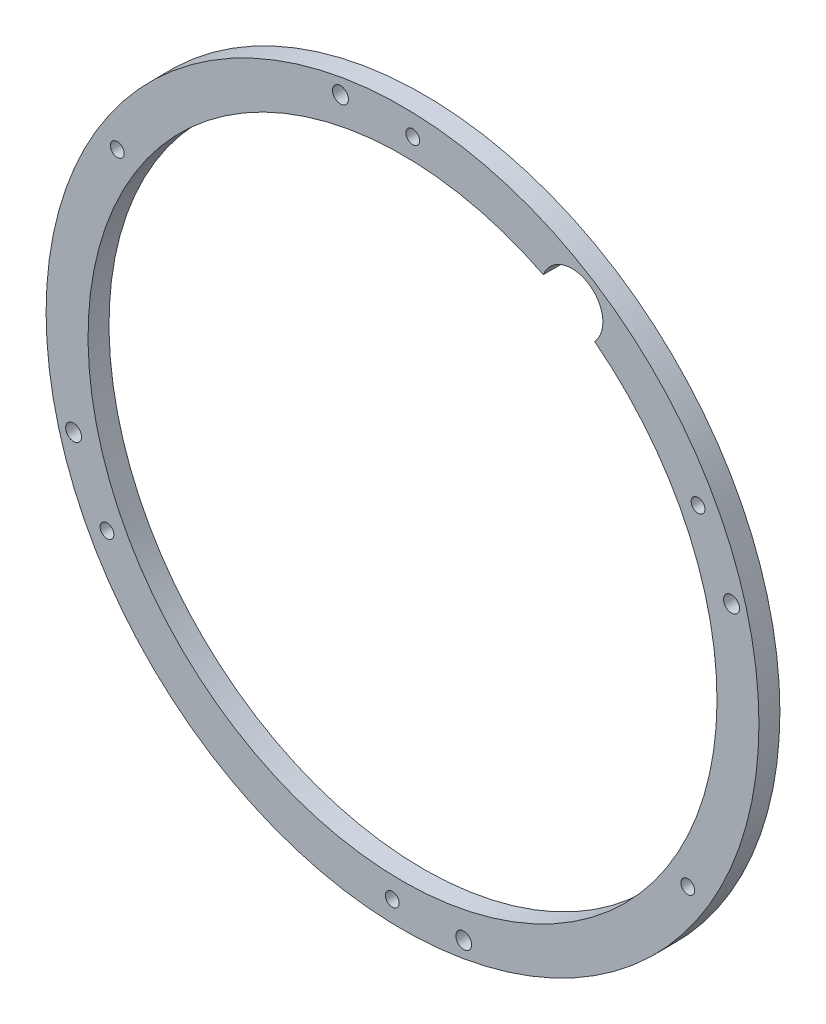
ISO-10303-21;
HEADER;
FILE_DESCRIPTION(('STEP AP214'),'2;1');
FILE_NAME('part.step','',(''),(''),'','','');
FILE_SCHEMA(('AUTOMOTIVE_DESIGN { 1 0 10303 214 1 1 1 1 }'));
ENDSEC;
DATA;
#1=APPLICATION_CONTEXT('core data for automotive mechanical design processes');
#2=APPLICATION_PROTOCOL_DEFINITION('international standard','automotive_design',2000,#1);
#3=PRODUCT_CONTEXT('',#1,'mechanical');
#4=PRODUCT('Part','Part','',(#3));
#5=PRODUCT_RELATED_PRODUCT_CATEGORY('part','',(#4));
#6=PRODUCT_DEFINITION_FORMATION('','',#4);
#7=PRODUCT_DEFINITION_CONTEXT('part definition',#1,'design');
#8=PRODUCT_DEFINITION('design','',#6,#7);
#9=PRODUCT_DEFINITION_SHAPE('','',#8);
#10=(LENGTH_UNIT() NAMED_UNIT(*) SI_UNIT(.MILLI.,.METRE.));
#11=(NAMED_UNIT(*) PLANE_ANGLE_UNIT() SI_UNIT($,.RADIAN.));
#12=(NAMED_UNIT(*) SI_UNIT($,.STERADIAN.) SOLID_ANGLE_UNIT());
#13=UNCERTAINTY_MEASURE_WITH_UNIT(LENGTH_MEASURE(1.E-05),#10,'distance_accuracy_value','');
#14=(GEOMETRIC_REPRESENTATION_CONTEXT(3) GLOBAL_UNCERTAINTY_ASSIGNED_CONTEXT((#13)) GLOBAL_UNIT_ASSIGNED_CONTEXT((#10,
#11,#12)) REPRESENTATION_CONTEXT('',''));
#15=CARTESIAN_POINT('',(0.,0.,0.));
#16=DIRECTION('',(0.,0.,1.));
#17=DIRECTION('',(1.,0.,0.));
#18=AXIS2_PLACEMENT_3D('',#15,#16,#17);
#19=CARTESIAN_POINT('',(14.579508869943,23.2500080231191,6.35));
#20=DIRECTION('',(0.,0.,1.));
#21=DIRECTION('',(1.,0.,0.));
#22=AXIS2_PLACEMENT_3D('',#19,#20,#21);
#23=PLANE('',#22);
#24=CARTESIAN_POINT('',(33.1166264041862,-78.2291450408689,6.35));
#25=DIRECTION('',(0.,0.,1.));
#26=DIRECTION('',(1.,0.,0.));
#27=AXIS2_PLACEMENT_3D('',#24,#25,#26);
#28=CIRCLE('',#27,2.41300000000001);
#29=CARTESIAN_POINT('',(35.5296264041862,-78.2291450408689,6.35));
#30=VERTEX_POINT('',#29);
#31=EDGE_CURVE('E154',#30,#30,#28,.T.);
#32=ORIENTED_EDGE('',*,*,#31,.F.);
#33=EDGE_LOOP('',(#32));
#34=FACE_BOUND('',#33,.T.);
#35=CARTESIAN_POINT('',(-85.036904703232,-4.07322621378707,6.35));
#36=DIRECTION('',(0.,0.,1.));
#37=DIRECTION('',(1.,0.,0.));
#38=AXIS2_PLACEMENT_3D('',#35,#36,#37);
#39=CIRCLE('',#38,2.41299999999998);
#40=CARTESIAN_POINT('',(-82.623904703232,-4.07322621378707,6.35));
#41=VERTEX_POINT('',#40);
#42=EDGE_CURVE('E162',#41,#41,#39,.T.);
#43=ORIENTED_EDGE('',*,*,#42,.F.);
#44=EDGE_LOOP('',(#43));
#45=FACE_BOUND('',#44,.T.);
#46=CARTESIAN_POINT('',(65.9241558137416,105.010280384373,6.35));
#47=DIRECTION('',(0.,0.,-1.));
#48=DIRECTION('',(-1.,0.,0.));
#49=AXIS2_PLACEMENT_3D('',#46,#47,#48);
#50=CIRCLE('',#49,9.33859700277711);
#51=CARTESIAN_POINT('',(57.229420883947,108.417768972892,6.35));
#52=VERTEX_POINT('',#51);
#53=CARTESIAN_POINT('',(72.769903610202,98.6584986589409,6.35));
#54=VERTEX_POINT('',#53);
#55=EDGE_CURVE('E50',#52,#54,#50,.T.);
#56=ORIENTED_EDGE('',*,*,#55,.T.);
#57=CARTESIAN_POINT('',(14.579508869943,23.2500080231191,6.35));
#58=DIRECTION('',(0.,0.,1.));
#59=DIRECTION('',(1.,0.,0.));
#60=AXIS2_PLACEMENT_3D('',#57,#58,#59);
#61=CIRCLE('',#60,95.25);
#62=EDGE_CURVE('E74',#52,#54,#61,.T.);
#63=ORIENTED_EDGE('',*,*,#62,.F.);
#64=EDGE_LOOP('',(#56,#63));
#65=FACE_BOUND('',#64,.T.);
#66=CARTESIAN_POINT('',(-4.21577369813635,124.891191498642,6.35));
#67=DIRECTION('',(0.,0.,1.));
#68=DIRECTION('',(1.,0.,0.));
#69=AXIS2_PLACEMENT_3D('',#66,#67,#68);
#70=CIRCLE('',#69,2.41299999999999);
#71=CARTESIAN_POINT('',(-1.80277369813635,124.891191498642,6.35));
#72=VERTEX_POINT('',#71);
#73=EDGE_CURVE('E75',#72,#72,#70,.T.);
#74=ORIENTED_EDGE('',*,*,#73,.F.);
#75=EDGE_LOOP('',(#74));
#76=FACE_BOUND('',#75,.T.);
#77=CARTESIAN_POINT('',(17.6904679428843,124.802368574937,6.35));
#78=DIRECTION('',(0.,0.,1.));
#79=DIRECTION('',(1.,0.,0.));
#80=AXIS2_PLACEMENT_3D('',#77,#78,#79);
#81=CIRCLE('',#80,2.08500000000001);
#82=CARTESIAN_POINT('',(19.7754679428843,124.802368574937,6.35));
#83=VERTEX_POINT('',#82);
#84=EDGE_CURVE('E81',#83,#83,#81,.T.);
#85=ORIENTED_EDGE('',*,*,#84,.F.);
#86=EDGE_LOOP('',(#85));
#87=FACE_BOUND('',#86,.T.);
#88=CARTESIAN_POINT('',(-71.8119356457378,76.7203578863291,6.35));
#89=DIRECTION('',(0.,0.,1.));
#90=DIRECTION('',(1.,0.,0.));
#91=AXIS2_PLACEMENT_3D('',#88,#89,#90);
#92=CIRCLE('',#91,2.085);
#93=CARTESIAN_POINT('',(-69.7269356457378,76.7203578863291,6.35));
#94=VERTEX_POINT('',#93);
#95=EDGE_CURVE('E208',#94,#94,#92,.T.);
#96=ORIENTED_EDGE('',*,*,#95,.F.);
#97=EDGE_LOOP('',(#96));
#98=FACE_BOUND('',#97,.T.);
#99=CARTESIAN_POINT('',(-74.9228947186793,-24.8320026654892,6.35));
#100=DIRECTION('',(0.,0.,1.));
#101=DIRECTION('',(1.,0.,0.));
#102=AXIS2_PLACEMENT_3D('',#99,#100,#101);
#103=CIRCLE('',#102,2.085);
#104=CARTESIAN_POINT('',(-72.8378947186793,-24.8320026654892,6.35));
#105=VERTEX_POINT('',#104);
#106=EDGE_CURVE('E205',#105,#105,#103,.T.);
#107=ORIENTED_EDGE('',*,*,#106,.F.);
#108=EDGE_LOOP('',(#107));
#109=FACE_BOUND('',#108,.T.);
#110=CARTESIAN_POINT('',(11.4685497970013,-78.3023525286994,6.35));
#111=DIRECTION('',(0.,0.,1.));
#112=DIRECTION('',(1.,0.,0.));
#113=AXIS2_PLACEMENT_3D('',#110,#111,#112);
#114=CIRCLE('',#113,2.08499999999999);
#115=CARTESIAN_POINT('',(13.5535497970013,-78.3023525286994,6.35));
#116=VERTEX_POINT('',#115);
#117=EDGE_CURVE('E201',#116,#116,#114,.T.);
#118=ORIENTED_EDGE('',*,*,#117,.F.);
#119=EDGE_LOOP('',(#118));
#120=FACE_BOUND('',#119,.T.);
#121=CARTESIAN_POINT('',(100.970953385623,-30.2203418400912,6.35));
#122=DIRECTION('',(0.,0.,1.));
#123=DIRECTION('',(1.,0.,0.));
#124=AXIS2_PLACEMENT_3D('',#121,#122,#123);
#125=CIRCLE('',#124,2.085);
#126=CARTESIAN_POINT('',(103.055953385623,-30.2203418400912,6.35));
#127=VERTEX_POINT('',#126);
#128=EDGE_CURVE('E198',#127,#127,#125,.T.);
#129=ORIENTED_EDGE('',*,*,#128,.F.);
#130=EDGE_LOOP('',(#129));
#131=FACE_BOUND('',#130,.T.);
#132=CARTESIAN_POINT('',(114.220260225982,50.557967298227,6.35));
#133=DIRECTION('',(0.,0.,1.));
#134=DIRECTION('',(1.,0.,0.));
#135=AXIS2_PLACEMENT_3D('',#132,#133,#134);
#136=CIRCLE('',#135,2.41299999999999);
#137=CARTESIAN_POINT('',(116.633260225982,50.557967298227,6.35));
#138=VERTEX_POINT('',#137);
#139=EDGE_CURVE('E195',#138,#138,#136,.T.);
#140=ORIENTED_EDGE('',*,*,#139,.F.);
#141=EDGE_LOOP('',(#140));
#142=FACE_BOUND('',#141,.T.);
#143=CARTESIAN_POINT('',(104.081912458565,71.3320187117289,6.35));
#144=DIRECTION('',(0.,0.,1.));
#145=DIRECTION('',(1.,0.,0.));
#146=AXIS2_PLACEMENT_3D('',#143,#144,#145);
#147=CIRCLE('',#146,2.08499999999923);
#148=CARTESIAN_POINT('',(106.166912458564,71.3320187117289,6.35));
#149=VERTEX_POINT('',#148);
#150=EDGE_CURVE('E192',#149,#149,#147,.T.);
#151=ORIENTED_EDGE('',*,*,#150,.F.);
#152=EDGE_LOOP('',(#151));
#153=FACE_BOUND('',#152,.T.);
#154=CARTESIAN_POINT('',(14.579508869943,23.2500080231191,6.35));
#155=DIRECTION('',(0.,0.,1.));
#156=DIRECTION('',(1.,0.,0.));
#157=AXIS2_PLACEMENT_3D('',#154,#155,#156);
#158=CIRCLE('',#157,107.95);
#159=CARTESIAN_POINT('',(122.529508869943,23.2500080231191,6.35));
#160=VERTEX_POINT('',#159);
#161=EDGE_CURVE('E65',#160,#160,#158,.T.);
#162=ORIENTED_EDGE('',*,*,#161,.T.);
#163=EDGE_LOOP('',(#162));
#164=FACE_BOUND('',#163,.T.);
#165=ADVANCED_FACE('F36',(#34,#45,#65,#76,#87,#98,#109,#120,#131,#142,#153,#164),#23,.T.);
#166=CARTESIAN_POINT('',(14.579508869943,23.2500080231191,0.));
#167=DIRECTION('',(0.,0.,1.));
#168=DIRECTION('',(1.,0.,0.));
#169=AXIS2_PLACEMENT_3D('',#166,#167,#168);
#170=PLANE('',#169);
#171=CARTESIAN_POINT('',(33.1166264041862,-78.2291450408689,0.));
#172=DIRECTION('',(0.,0.,1.));
#173=DIRECTION('',(1.,0.,0.));
#174=AXIS2_PLACEMENT_3D('',#171,#172,#173);
#175=CIRCLE('',#174,2.41300000000001);
#176=CARTESIAN_POINT('',(35.5296264041862,-78.2291450408689,0.));
#177=VERTEX_POINT('',#176);
#178=EDGE_CURVE('E70',#177,#177,#175,.T.);
#179=ORIENTED_EDGE('',*,*,#178,.T.);
#180=EDGE_LOOP('',(#179));
#181=FACE_BOUND('',#180,.T.);
#182=CARTESIAN_POINT('',(-85.036904703232,-4.07322621378707,0.));
#183=DIRECTION('',(0.,0.,1.));
#184=DIRECTION('',(1.,0.,0.));
#185=AXIS2_PLACEMENT_3D('',#182,#183,#184);
#186=CIRCLE('',#185,2.41299999999998);
#187=CARTESIAN_POINT('',(-82.623904703232,-4.07322621378707,0.));
#188=VERTEX_POINT('',#187);
#189=EDGE_CURVE('E156',#188,#188,#186,.T.);
#190=ORIENTED_EDGE('',*,*,#189,.T.);
#191=EDGE_LOOP('',(#190));
#192=FACE_BOUND('',#191,.T.);
#193=CARTESIAN_POINT('',(-4.21577369813635,124.891191498642,0.));
#194=DIRECTION('',(0.,0.,-1.));
#195=DIRECTION('',(-1.,0.,0.));
#196=AXIS2_PLACEMENT_3D('',#193,#194,#195);
#197=CIRCLE('',#196,2.41299999999999);
#198=CARTESIAN_POINT('',(-6.62877369813634,124.891191498642,0.));
#199=VERTEX_POINT('',#198);
#200=EDGE_CURVE('E178',#199,#199,#197,.T.);
#201=ORIENTED_EDGE('',*,*,#200,.F.);
#202=EDGE_LOOP('',(#201));
#203=FACE_BOUND('',#202,.T.);
#204=CARTESIAN_POINT('',(17.6904679428843,124.802368574937,0.));
#205=DIRECTION('',(0.,0.,-1.));
#206=DIRECTION('',(-1.,0.,0.));
#207=AXIS2_PLACEMENT_3D('',#204,#205,#206);
#208=CIRCLE('',#207,2.08500000000001);
#209=CARTESIAN_POINT('',(15.6054679428843,124.802368574937,0.));
#210=VERTEX_POINT('',#209);
#211=EDGE_CURVE('E182',#210,#210,#208,.T.);
#212=ORIENTED_EDGE('',*,*,#211,.F.);
#213=EDGE_LOOP('',(#212));
#214=FACE_BOUND('',#213,.T.);
#215=CARTESIAN_POINT('',(-71.8119356457378,76.7203578863291,0.));
#216=DIRECTION('',(0.,0.,-1.));
#217=DIRECTION('',(-1.,0.,0.));
#218=AXIS2_PLACEMENT_3D('',#215,#216,#217);
#219=CIRCLE('',#218,2.085);
#220=CARTESIAN_POINT('',(-73.8969356457378,76.7203578863291,0.));
#221=VERTEX_POINT('',#220);
#222=EDGE_CURVE('E185',#221,#221,#219,.T.);
#223=ORIENTED_EDGE('',*,*,#222,.F.);
#224=EDGE_LOOP('',(#223));
#225=FACE_BOUND('',#224,.T.);
#226=CARTESIAN_POINT('',(-74.9228947186793,-24.8320026654892,0.));
#227=DIRECTION('',(0.,0.,-1.));
#228=DIRECTION('',(-1.,0.,0.));
#229=AXIS2_PLACEMENT_3D('',#226,#227,#228);
#230=CIRCLE('',#229,2.085);
#231=CARTESIAN_POINT('',(-77.0078947186793,-24.8320026654892,0.));
#232=VERTEX_POINT('',#231);
#233=EDGE_CURVE('E172',#232,#232,#230,.T.);
#234=ORIENTED_EDGE('',*,*,#233,.F.);
#235=EDGE_LOOP('',(#234));
#236=FACE_BOUND('',#235,.T.);
#237=CARTESIAN_POINT('',(11.4685497970013,-78.3023525286994,0.));
#238=DIRECTION('',(0.,0.,-1.));
#239=DIRECTION('',(-1.,0.,0.));
#240=AXIS2_PLACEMENT_3D('',#237,#238,#239);
#241=CIRCLE('',#240,2.08499999999999);
#242=CARTESIAN_POINT('',(9.38354979700133,-78.3023525286994,0.));
#243=VERTEX_POINT('',#242);
#244=EDGE_CURVE('E169',#243,#243,#241,.T.);
#245=ORIENTED_EDGE('',*,*,#244,.F.);
#246=EDGE_LOOP('',(#245));
#247=FACE_BOUND('',#246,.T.);
#248=CARTESIAN_POINT('',(100.970953385623,-30.2203418400912,0.));
#249=DIRECTION('',(0.,0.,-1.));
#250=DIRECTION('',(-1.,0.,0.));
#251=AXIS2_PLACEMENT_3D('',#248,#249,#250);
#252=CIRCLE('',#251,2.085);
#253=CARTESIAN_POINT('',(98.8859533856234,-30.2203418400912,0.));
#254=VERTEX_POINT('',#253);
#255=EDGE_CURVE('E173',#254,#254,#252,.T.);
#256=ORIENTED_EDGE('',*,*,#255,.F.);
#257=EDGE_LOOP('',(#256));
#258=FACE_BOUND('',#257,.T.);
#259=CARTESIAN_POINT('',(114.220260225982,50.557967298227,0.));
#260=DIRECTION('',(0.,0.,-1.));
#261=DIRECTION('',(-1.,0.,0.));
#262=AXIS2_PLACEMENT_3D('',#259,#260,#261);
#263=CIRCLE('',#262,2.41299999999999);
#264=CARTESIAN_POINT('',(111.807260225982,50.557967298227,0.));
#265=VERTEX_POINT('',#264);
#266=EDGE_CURVE('E167',#265,#265,#263,.T.);
#267=ORIENTED_EDGE('',*,*,#266,.F.);
#268=EDGE_LOOP('',(#267));
#269=FACE_BOUND('',#268,.T.);
#270=CARTESIAN_POINT('',(104.081912458565,71.3320187117289,0.));
#271=DIRECTION('',(0.,0.,-1.));
#272=DIRECTION('',(-1.,0.,0.));
#273=AXIS2_PLACEMENT_3D('',#270,#271,#272);
#274=CIRCLE('',#273,2.08499999999923);
#275=CARTESIAN_POINT('',(101.996912458565,71.3320187117289,0.));
#276=VERTEX_POINT('',#275);
#277=EDGE_CURVE('E181',#276,#276,#274,.T.);
#278=ORIENTED_EDGE('',*,*,#277,.F.);
#279=EDGE_LOOP('',(#278));
#280=FACE_BOUND('',#279,.T.);
#281=CARTESIAN_POINT('',(14.579508869943,23.2500080231191,0.));
#282=DIRECTION('',(0.,0.,1.));
#283=DIRECTION('',(1.,0.,0.));
#284=AXIS2_PLACEMENT_3D('',#281,#282,#283);
#285=CIRCLE('',#284,107.95);
#286=CARTESIAN_POINT('',(122.529508869943,23.2500080231191,0.));
#287=VERTEX_POINT('',#286);
#288=EDGE_CURVE('E78',#287,#287,#285,.T.);
#289=ORIENTED_EDGE('',*,*,#288,.F.);
#290=EDGE_LOOP('',(#289));
#291=FACE_BOUND('',#290,.T.);
#292=CARTESIAN_POINT('',(14.579508869943,23.2500080231191,0.));
#293=DIRECTION('',(0.,0.,1.));
#294=DIRECTION('',(1.,0.,0.));
#295=AXIS2_PLACEMENT_3D('',#292,#293,#294);
#296=CIRCLE('',#295,95.25);
#297=CARTESIAN_POINT('',(57.229420883947,108.417768972892,0.));
#298=VERTEX_POINT('',#297);
#299=CARTESIAN_POINT('',(72.769903610202,98.6584986589409,0.));
#300=VERTEX_POINT('',#299);
#301=EDGE_CURVE('E69',#298,#300,#296,.T.);
#302=ORIENTED_EDGE('',*,*,#301,.T.);
#303=CARTESIAN_POINT('',(65.9241558137416,105.010280384373,0.));
#304=DIRECTION('',(0.,0.,-1.));
#305=DIRECTION('',(-1.,0.,0.));
#306=AXIS2_PLACEMENT_3D('',#303,#304,#305);
#307=CIRCLE('',#306,9.33859700277711);
#308=EDGE_CURVE('E60',#298,#300,#307,.T.);
#309=ORIENTED_EDGE('',*,*,#308,.F.);
#310=EDGE_LOOP('',(#302,#309));
#311=FACE_BOUND('',#310,.T.);
#312=ADVANCED_FACE('F68',(#181,#192,#203,#214,#225,#236,#247,#258,#269,#280,#291,#311),#170,.F.);
#313=CARTESIAN_POINT('',(14.579508869943,23.2500080231191,6.35));
#314=DIRECTION('',(0.,0.,-1.));
#315=DIRECTION('',(-1.,0.,0.));
#316=AXIS2_PLACEMENT_3D('',#313,#314,#315);
#317=CYLINDRICAL_SURFACE('',#316,107.95);
#318=ORIENTED_EDGE('',*,*,#161,.F.);
#319=EDGE_LOOP('',(#318));
#320=FACE_BOUND('',#319,.T.);
#321=ORIENTED_EDGE('',*,*,#288,.T.);
#322=EDGE_LOOP('',(#321));
#323=FACE_BOUND('',#322,.T.);
#324=ADVANCED_FACE('F38',(#320,#323),#317,.T.);
#325=CARTESIAN_POINT('',(14.579508869943,23.2500080231191,6.35));
#326=DIRECTION('',(0.,0.,-1.));
#327=DIRECTION('',(-1.,0.,0.));
#328=AXIS2_PLACEMENT_3D('',#325,#326,#327);
#329=CYLINDRICAL_SURFACE('',#328,95.25);
#330=DIRECTION('',(0.,0.,-1.));
#331=VECTOR('',#330,1.);
#332=CARTESIAN_POINT('',(72.769903610202,98.6584986589409,3.175));
#333=LINE('',#332,#331);
#334=EDGE_CURVE('E11',#300,#54,#333,.F.);
#335=ORIENTED_EDGE('',*,*,#334,.F.);
#336=ORIENTED_EDGE('',*,*,#301,.F.);
#337=DIRECTION('',(0.,0.,-1.));
#338=VECTOR('',#337,1.);
#339=CARTESIAN_POINT('',(57.229420883947,108.417768972892,3.175));
#340=LINE('',#339,#338);
#341=EDGE_CURVE('E44',#52,#298,#340,.T.);
#342=ORIENTED_EDGE('',*,*,#341,.F.);
#343=ORIENTED_EDGE('',*,*,#62,.T.);
#344=EDGE_LOOP('',(#335,#336,#342,#343));
#345=FACE_BOUND('',#344,.T.);
#346=ADVANCED_FACE('F72',(#345),#329,.F.);
#347=CARTESIAN_POINT('',(104.081912458565,71.3320187117289,21.336));
#348=DIRECTION('',(0.,0.,-1.));
#349=DIRECTION('',(-1.,0.,0.));
#350=AXIS2_PLACEMENT_3D('',#347,#348,#349);
#351=CYLINDRICAL_SURFACE('',#350,2.08499999999923);
#352=ORIENTED_EDGE('',*,*,#150,.T.);
#353=EDGE_LOOP('',(#352));
#354=FACE_BOUND('',#353,.T.);
#355=ORIENTED_EDGE('',*,*,#277,.T.);
#356=EDGE_LOOP('',(#355));
#357=FACE_BOUND('',#356,.T.);
#358=ADVANCED_FACE('F107',(#354,#357),#351,.F.);
#359=CARTESIAN_POINT('',(114.220260225982,50.557967298227,21.336));
#360=DIRECTION('',(0.,0.,-1.));
#361=DIRECTION('',(-1.,0.,0.));
#362=AXIS2_PLACEMENT_3D('',#359,#360,#361);
#363=CYLINDRICAL_SURFACE('',#362,2.41299999999999);
#364=ORIENTED_EDGE('',*,*,#139,.T.);
#365=EDGE_LOOP('',(#364));
#366=FACE_BOUND('',#365,.T.);
#367=ORIENTED_EDGE('',*,*,#266,.T.);
#368=EDGE_LOOP('',(#367));
#369=FACE_BOUND('',#368,.T.);
#370=ADVANCED_FACE('F110',(#366,#369),#363,.F.);
#371=CARTESIAN_POINT('',(100.970953385623,-30.2203418400912,21.336));
#372=DIRECTION('',(0.,0.,-1.));
#373=DIRECTION('',(-1.,0.,0.));
#374=AXIS2_PLACEMENT_3D('',#371,#372,#373);
#375=CYLINDRICAL_SURFACE('',#374,2.085);
#376=ORIENTED_EDGE('',*,*,#128,.T.);
#377=EDGE_LOOP('',(#376));
#378=FACE_BOUND('',#377,.T.);
#379=ORIENTED_EDGE('',*,*,#255,.T.);
#380=EDGE_LOOP('',(#379));
#381=FACE_BOUND('',#380,.T.);
#382=ADVANCED_FACE('F131',(#378,#381),#375,.F.);
#383=CARTESIAN_POINT('',(11.4685497970013,-78.3023525286994,21.336));
#384=DIRECTION('',(0.,0.,-1.));
#385=DIRECTION('',(-1.,0.,0.));
#386=AXIS2_PLACEMENT_3D('',#383,#384,#385);
#387=CYLINDRICAL_SURFACE('',#386,2.08499999999999);
#388=ORIENTED_EDGE('',*,*,#117,.T.);
#389=EDGE_LOOP('',(#388));
#390=FACE_BOUND('',#389,.T.);
#391=ORIENTED_EDGE('',*,*,#244,.T.);
#392=EDGE_LOOP('',(#391));
#393=FACE_BOUND('',#392,.T.);
#394=ADVANCED_FACE('F116',(#390,#393),#387,.F.);
#395=CARTESIAN_POINT('',(-74.9228947186793,-24.8320026654892,21.336));
#396=DIRECTION('',(0.,0.,-1.));
#397=DIRECTION('',(-1.,0.,0.));
#398=AXIS2_PLACEMENT_3D('',#395,#396,#397);
#399=CYLINDRICAL_SURFACE('',#398,2.085);
#400=ORIENTED_EDGE('',*,*,#106,.T.);
#401=EDGE_LOOP('',(#400));
#402=FACE_BOUND('',#401,.T.);
#403=ORIENTED_EDGE('',*,*,#233,.T.);
#404=EDGE_LOOP('',(#403));
#405=FACE_BOUND('',#404,.T.);
#406=ADVANCED_FACE('F112',(#402,#405),#399,.F.);
#407=CARTESIAN_POINT('',(-71.8119356457378,76.7203578863291,21.336));
#408=DIRECTION('',(0.,0.,-1.));
#409=DIRECTION('',(-1.,0.,0.));
#410=AXIS2_PLACEMENT_3D('',#407,#408,#409);
#411=CYLINDRICAL_SURFACE('',#410,2.085);
#412=ORIENTED_EDGE('',*,*,#95,.T.);
#413=EDGE_LOOP('',(#412));
#414=FACE_BOUND('',#413,.T.);
#415=ORIENTED_EDGE('',*,*,#222,.T.);
#416=EDGE_LOOP('',(#415));
#417=FACE_BOUND('',#416,.T.);
#418=ADVANCED_FACE('F115',(#414,#417),#411,.F.);
#419=CARTESIAN_POINT('',(17.6904679428843,124.802368574937,21.336));
#420=DIRECTION('',(0.,0.,-1.));
#421=DIRECTION('',(-1.,0.,0.));
#422=AXIS2_PLACEMENT_3D('',#419,#420,#421);
#423=CYLINDRICAL_SURFACE('',#422,2.08500000000001);
#424=ORIENTED_EDGE('',*,*,#84,.T.);
#425=EDGE_LOOP('',(#424));
#426=FACE_BOUND('',#425,.T.);
#427=ORIENTED_EDGE('',*,*,#211,.T.);
#428=EDGE_LOOP('',(#427));
#429=FACE_BOUND('',#428,.T.);
#430=ADVANCED_FACE('F120',(#426,#429),#423,.F.);
#431=CARTESIAN_POINT('',(-4.21577369813635,124.891191498642,21.336));
#432=DIRECTION('',(0.,0.,-1.));
#433=DIRECTION('',(-1.,0.,0.));
#434=AXIS2_PLACEMENT_3D('',#431,#432,#433);
#435=CYLINDRICAL_SURFACE('',#434,2.41299999999999);
#436=ORIENTED_EDGE('',*,*,#73,.T.);
#437=EDGE_LOOP('',(#436));
#438=FACE_BOUND('',#437,.T.);
#439=ORIENTED_EDGE('',*,*,#200,.T.);
#440=EDGE_LOOP('',(#439));
#441=FACE_BOUND('',#440,.T.);
#442=ADVANCED_FACE('F124',(#438,#441),#435,.F.);
#443=CARTESIAN_POINT('',(65.9241558137416,105.010280384373,6.35));
#444=DIRECTION('',(0.,0.,-1.));
#445=DIRECTION('',(-1.,0.,0.));
#446=AXIS2_PLACEMENT_3D('',#443,#444,#445);
#447=CYLINDRICAL_SURFACE('',#446,9.33859700277711);
#448=ORIENTED_EDGE('',*,*,#334,.T.);
#449=ORIENTED_EDGE('',*,*,#55,.F.);
#450=ORIENTED_EDGE('',*,*,#341,.T.);
#451=ORIENTED_EDGE('',*,*,#308,.T.);
#452=EDGE_LOOP('',(#448,#449,#450,#451));
#453=FACE_BOUND('',#452,.T.);
#454=ADVANCED_FACE('F59',(#453),#447,.F.);
#455=CARTESIAN_POINT('',(-85.036904703232,-4.07322621378707,0.));
#456=DIRECTION('',(0.,0.,1.));
#457=DIRECTION('',(1.,0.,0.));
#458=AXIS2_PLACEMENT_3D('',#455,#456,#457);
#459=CYLINDRICAL_SURFACE('',#458,2.41299999999998);
#460=ORIENTED_EDGE('',*,*,#189,.F.);
#461=EDGE_LOOP('',(#460));
#462=FACE_BOUND('',#461,.T.);
#463=ORIENTED_EDGE('',*,*,#42,.T.);
#464=EDGE_LOOP('',(#463));
#465=FACE_BOUND('',#464,.T.);
#466=ADVANCED_FACE('F141',(#462,#465),#459,.F.);
#467=CARTESIAN_POINT('',(33.1166264041862,-78.2291450408689,0.));
#468=DIRECTION('',(0.,0.,1.));
#469=DIRECTION('',(1.,0.,0.));
#470=AXIS2_PLACEMENT_3D('',#467,#468,#469);
#471=CYLINDRICAL_SURFACE('',#470,2.41300000000001);
#472=ORIENTED_EDGE('',*,*,#178,.F.);
#473=EDGE_LOOP('',(#472));
#474=FACE_BOUND('',#473,.T.);
#475=ORIENTED_EDGE('',*,*,#31,.T.);
#476=EDGE_LOOP('',(#475));
#477=FACE_BOUND('',#476,.T.);
#478=ADVANCED_FACE('F144',(#474,#477),#471,.F.);
#479=CLOSED_SHELL('',(#165,#312,#324,#346,#358,#370,#382,#394,#406,#418,#430,#442,#454,#466,#478));
#480=MANIFOLD_SOLID_BREP('B2',#479);
#481=ADVANCED_BREP_SHAPE_REPRESENTATION('',(#18,#480),#14);
#482=SHAPE_DEFINITION_REPRESENTATION(#9,#481);
ENDSEC;
END-ISO-10303-21;
